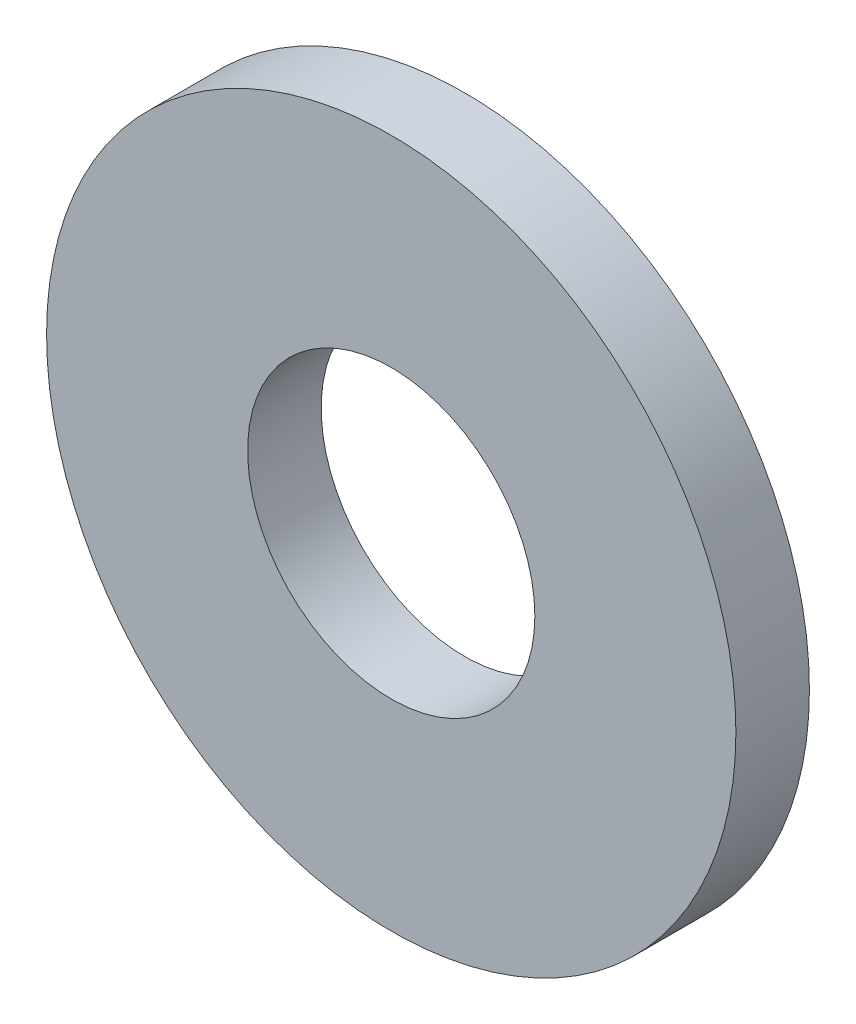
ISO-10303-21;
HEADER;
FILE_DESCRIPTION(('STEP AP214'),'2;1');
FILE_NAME('part.step','',(''),(''),'','','');
FILE_SCHEMA(('AUTOMOTIVE_DESIGN { 1 0 10303 214 1 1 1 1 }'));
ENDSEC;
DATA;
#1=APPLICATION_CONTEXT('core data for automotive mechanical design processes');
#2=APPLICATION_PROTOCOL_DEFINITION('international standard','automotive_design',2000,#1);
#3=PRODUCT_CONTEXT('',#1,'mechanical');
#4=PRODUCT('Part','Part','',(#3));
#5=PRODUCT_RELATED_PRODUCT_CATEGORY('part','',(#4));
#6=PRODUCT_DEFINITION_FORMATION('','',#4);
#7=PRODUCT_DEFINITION_CONTEXT('part definition',#1,'design');
#8=PRODUCT_DEFINITION('design','',#6,#7);
#9=PRODUCT_DEFINITION_SHAPE('','',#8);
#10=(LENGTH_UNIT() NAMED_UNIT(*) SI_UNIT(.MILLI.,.METRE.));
#11=(NAMED_UNIT(*) PLANE_ANGLE_UNIT() SI_UNIT($,.RADIAN.));
#12=(NAMED_UNIT(*) SI_UNIT($,.STERADIAN.) SOLID_ANGLE_UNIT());
#13=UNCERTAINTY_MEASURE_WITH_UNIT(LENGTH_MEASURE(1.E-05),#10,'distance_accuracy_value','');
#14=(GEOMETRIC_REPRESENTATION_CONTEXT(3) GLOBAL_UNCERTAINTY_ASSIGNED_CONTEXT((#13)) GLOBAL_UNIT_ASSIGNED_CONTEXT((#10,
#11,#12)) REPRESENTATION_CONTEXT('',''));
#15=CARTESIAN_POINT('',(0.,0.,0.));
#16=DIRECTION('',(0.,0.,1.));
#17=DIRECTION('',(1.,0.,0.));
#18=AXIS2_PLACEMENT_3D('',#15,#16,#17);
#19=CARTESIAN_POINT('',(0.,0.,-2.032));
#20=DIRECTION('',(0.,0.,1.));
#21=DIRECTION('',(1.,0.,0.));
#22=AXIS2_PLACEMENT_3D('',#19,#20,#21);
#23=CYLINDRICAL_SURFACE('',#22,9.525);
#24=CARTESIAN_POINT('',(0.,0.,-2.032));
#25=DIRECTION('',(0.,0.,1.));
#26=DIRECTION('',(1.,0.,0.));
#27=AXIS2_PLACEMENT_3D('',#24,#25,#26);
#28=CIRCLE('',#27,9.525);
#29=CARTESIAN_POINT('',(9.525,0.,-2.032));
#30=VERTEX_POINT('',#29);
#31=EDGE_CURVE('E10',#30,#30,#28,.T.);
#32=ORIENTED_EDGE('',*,*,#31,.T.);
#33=EDGE_LOOP('',(#32));
#34=FACE_BOUND('',#33,.T.);
#35=CARTESIAN_POINT('',(0.,0.,0.));
#36=DIRECTION('',(0.,0.,1.));
#37=DIRECTION('',(1.,0.,0.));
#38=AXIS2_PLACEMENT_3D('',#35,#36,#37);
#39=CIRCLE('',#38,9.525);
#40=CARTESIAN_POINT('',(9.525,0.,0.));
#41=VERTEX_POINT('',#40);
#42=EDGE_CURVE('E35',#41,#41,#39,.T.);
#43=ORIENTED_EDGE('',*,*,#42,.F.);
#44=EDGE_LOOP('',(#43));
#45=FACE_BOUND('',#44,.T.);
#46=ADVANCED_FACE('F32',(#34,#45),#23,.T.);
#47=CARTESIAN_POINT('',(0.,0.,-2.032));
#48=DIRECTION('',(0.,0.,1.));
#49=DIRECTION('',(1.,0.,0.));
#50=AXIS2_PLACEMENT_3D('',#47,#48,#49);
#51=PLANE('',#50);
#52=CARTESIAN_POINT('',(0.,0.,-2.032));
#53=DIRECTION('',(0.,0.,1.));
#54=DIRECTION('',(1.,0.,0.));
#55=AXIS2_PLACEMENT_3D('',#52,#53,#54);
#56=CIRCLE('',#55,3.96875);
#57=CARTESIAN_POINT('',(3.96875,0.,-2.032));
#58=VERTEX_POINT('',#57);
#59=EDGE_CURVE('E42',#58,#58,#56,.T.);
#60=ORIENTED_EDGE('',*,*,#59,.T.);
#61=EDGE_LOOP('',(#60));
#62=FACE_BOUND('',#61,.T.);
#63=ORIENTED_EDGE('',*,*,#31,.F.);
#64=EDGE_LOOP('',(#63));
#65=FACE_BOUND('',#64,.T.);
#66=ADVANCED_FACE('F50',(#62,#65),#51,.F.);
#67=CARTESIAN_POINT('',(0.,0.,0.));
#68=DIRECTION('',(0.,0.,1.));
#69=DIRECTION('',(1.,0.,0.));
#70=AXIS2_PLACEMENT_3D('',#67,#68,#69);
#71=PLANE('',#70);
#72=CARTESIAN_POINT('',(0.,0.,0.));
#73=DIRECTION('',(0.,0.,1.));
#74=DIRECTION('',(1.,0.,0.));
#75=AXIS2_PLACEMENT_3D('',#72,#73,#74);
#76=CIRCLE('',#75,3.96875);
#77=CARTESIAN_POINT('',(3.96875,0.,0.));
#78=VERTEX_POINT('',#77);
#79=EDGE_CURVE('E44',#78,#78,#76,.T.);
#80=ORIENTED_EDGE('',*,*,#79,.F.);
#81=EDGE_LOOP('',(#80));
#82=FACE_BOUND('',#81,.T.);
#83=ORIENTED_EDGE('',*,*,#42,.T.);
#84=EDGE_LOOP('',(#83));
#85=FACE_BOUND('',#84,.T.);
#86=ADVANCED_FACE('F56',(#82,#85),#71,.T.);
#87=CARTESIAN_POINT('',(0.,0.,-2.032));
#88=DIRECTION('',(0.,0.,1.));
#89=DIRECTION('',(1.,0.,0.));
#90=AXIS2_PLACEMENT_3D('',#87,#88,#89);
#91=CYLINDRICAL_SURFACE('',#90,3.96875);
#92=ORIENTED_EDGE('',*,*,#59,.F.);
#93=EDGE_LOOP('',(#92));
#94=FACE_BOUND('',#93,.T.);
#95=ORIENTED_EDGE('',*,*,#79,.T.);
#96=EDGE_LOOP('',(#95));
#97=FACE_BOUND('',#96,.T.);
#98=ADVANCED_FACE('F53',(#94,#97),#91,.F.);
#99=CLOSED_SHELL('',(#46,#66,#86,#98));
#100=MANIFOLD_SOLID_BREP('B2',#99);
#101=ADVANCED_BREP_SHAPE_REPRESENTATION('',(#18,#100),#14);
#102=SHAPE_DEFINITION_REPRESENTATION(#9,#101);
ENDSEC;
END-ISO-10303-21;
